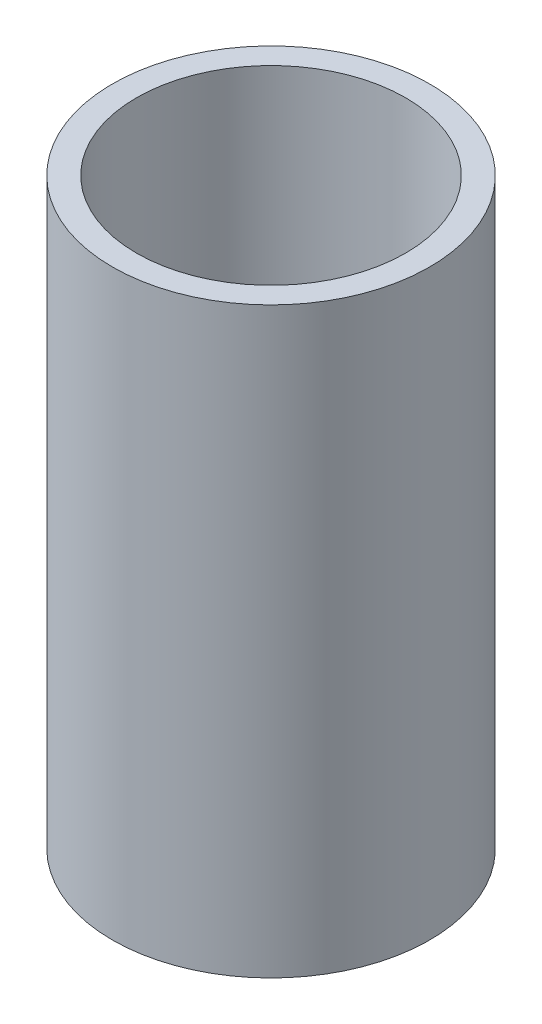
ISO-10303-21;
HEADER;
FILE_DESCRIPTION(('STEP AP214'),'2;1');
FILE_NAME('part.step','',(''),(''),'','','');
FILE_SCHEMA(('AUTOMOTIVE_DESIGN { 1 0 10303 214 1 1 1 1 }'));
ENDSEC;
DATA;
#1=APPLICATION_CONTEXT('core data for automotive mechanical design processes');
#2=APPLICATION_PROTOCOL_DEFINITION('international standard','automotive_design',2000,#1);
#3=PRODUCT_CONTEXT('',#1,'mechanical');
#4=PRODUCT('Part','Part','',(#3));
#5=PRODUCT_RELATED_PRODUCT_CATEGORY('part','',(#4));
#6=PRODUCT_DEFINITION_FORMATION('','',#4);
#7=PRODUCT_DEFINITION_CONTEXT('part definition',#1,'design');
#8=PRODUCT_DEFINITION('design','',#6,#7);
#9=PRODUCT_DEFINITION_SHAPE('','',#8);
#10=(LENGTH_UNIT() NAMED_UNIT(*) SI_UNIT(.MILLI.,.METRE.));
#11=(NAMED_UNIT(*) PLANE_ANGLE_UNIT() SI_UNIT($,.RADIAN.));
#12=(NAMED_UNIT(*) SI_UNIT($,.STERADIAN.) SOLID_ANGLE_UNIT());
#13=UNCERTAINTY_MEASURE_WITH_UNIT(LENGTH_MEASURE(1.E-05),#10,'distance_accuracy_value','');
#14=(GEOMETRIC_REPRESENTATION_CONTEXT(3) GLOBAL_UNCERTAINTY_ASSIGNED_CONTEXT((#13)) GLOBAL_UNIT_ASSIGNED_CONTEXT((#10,
#11,#12)) REPRESENTATION_CONTEXT('',''));
#15=CARTESIAN_POINT('',(0.,0.,0.));
#16=DIRECTION('',(0.,0.,1.));
#17=DIRECTION('',(1.,0.,0.));
#18=AXIS2_PLACEMENT_3D('',#15,#16,#17);
#19=CARTESIAN_POINT('',(0.,165.384012739095,0.));
#20=DIRECTION('',(0.,-1.,0.));
#21=DIRECTION('',(0.,0.,-1.));
#22=AXIS2_PLACEMENT_3D('',#19,#20,#21);
#23=CYLINDRICAL_SURFACE('',#22,45.);
#24=CARTESIAN_POINT('',(0.,165.384012739095,0.));
#25=DIRECTION('',(0.,1.,0.));
#26=DIRECTION('',(0.,0.,1.));
#27=AXIS2_PLACEMENT_3D('',#24,#25,#26);
#28=CIRCLE('',#27,45.);
#29=CARTESIAN_POINT('',(0.,165.384012739095,45.));
#30=VERTEX_POINT('',#29);
#31=EDGE_CURVE('E10',#30,#30,#28,.T.);
#32=ORIENTED_EDGE('',*,*,#31,.F.);
#33=EDGE_LOOP('',(#32));
#34=FACE_BOUND('',#33,.T.);
#35=CARTESIAN_POINT('',(0.,0.,0.));
#36=DIRECTION('',(0.,1.,0.));
#37=DIRECTION('',(0.,0.,1.));
#38=AXIS2_PLACEMENT_3D('',#35,#36,#37);
#39=CIRCLE('',#38,45.);
#40=CARTESIAN_POINT('',(0.,0.,45.));
#41=VERTEX_POINT('',#40);
#42=EDGE_CURVE('E37',#41,#41,#39,.T.);
#43=ORIENTED_EDGE('',*,*,#42,.T.);
#44=EDGE_LOOP('',(#43));
#45=FACE_BOUND('',#44,.T.);
#46=ADVANCED_FACE('F40',(#34,#45),#23,.T.);
#47=CARTESIAN_POINT('',(0.,165.384012739095,0.));
#48=DIRECTION('',(0.,1.,0.));
#49=DIRECTION('',(0.,0.,1.));
#50=AXIS2_PLACEMENT_3D('',#47,#48,#49);
#51=PLANE('',#50);
#52=CARTESIAN_POINT('',(0.,165.384012739095,0.));
#53=DIRECTION('',(0.,1.,0.));
#54=DIRECTION('',(0.,0.,1.));
#55=AXIS2_PLACEMENT_3D('',#52,#53,#54);
#56=CIRCLE('',#55,38.1855533880881);
#57=CARTESIAN_POINT('',(0.,165.384012739095,38.1855533880881));
#58=VERTEX_POINT('',#57);
#59=EDGE_CURVE('E50',#58,#58,#56,.T.);
#60=ORIENTED_EDGE('',*,*,#59,.F.);
#61=EDGE_LOOP('',(#60));
#62=FACE_BOUND('',#61,.T.);
#63=ORIENTED_EDGE('',*,*,#31,.T.);
#64=EDGE_LOOP('',(#63));
#65=FACE_BOUND('',#64,.T.);
#66=ADVANCED_FACE('F59',(#62,#65),#51,.T.);
#67=CARTESIAN_POINT('',(0.,0.,0.));
#68=DIRECTION('',(0.,1.,0.));
#69=DIRECTION('',(0.,0.,1.));
#70=AXIS2_PLACEMENT_3D('',#67,#68,#69);
#71=PLANE('',#70);
#72=CARTESIAN_POINT('',(0.,0.,0.));
#73=DIRECTION('',(0.,1.,0.));
#74=DIRECTION('',(0.,0.,1.));
#75=AXIS2_PLACEMENT_3D('',#72,#73,#74);
#76=CIRCLE('',#75,38.1855533880881);
#77=CARTESIAN_POINT('',(0.,0.,38.1855533880881));
#78=VERTEX_POINT('',#77);
#79=EDGE_CURVE('E47',#78,#78,#76,.T.);
#80=ORIENTED_EDGE('',*,*,#79,.T.);
#81=EDGE_LOOP('',(#80));
#82=FACE_BOUND('',#81,.T.);
#83=ORIENTED_EDGE('',*,*,#42,.F.);
#84=EDGE_LOOP('',(#83));
#85=FACE_BOUND('',#84,.T.);
#86=ADVANCED_FACE('F58',(#82,#85),#71,.F.);
#87=CARTESIAN_POINT('',(0.,165.384012739095,0.));
#88=DIRECTION('',(0.,-1.,0.));
#89=DIRECTION('',(0.,0.,-1.));
#90=AXIS2_PLACEMENT_3D('',#87,#88,#89);
#91=CYLINDRICAL_SURFACE('',#90,38.1855533880881);
#92=ORIENTED_EDGE('',*,*,#59,.T.);
#93=EDGE_LOOP('',(#92));
#94=FACE_BOUND('',#93,.T.);
#95=ORIENTED_EDGE('',*,*,#79,.F.);
#96=EDGE_LOOP('',(#95));
#97=FACE_BOUND('',#96,.T.);
#98=ADVANCED_FACE('F54',(#94,#97),#91,.F.);
#99=CLOSED_SHELL('',(#46,#66,#86,#98));
#100=MANIFOLD_SOLID_BREP('B2',#99);
#101=ADVANCED_BREP_SHAPE_REPRESENTATION('',(#18,#100),#14);
#102=SHAPE_DEFINITION_REPRESENTATION(#9,#101);
ENDSEC;
END-ISO-10303-21;
